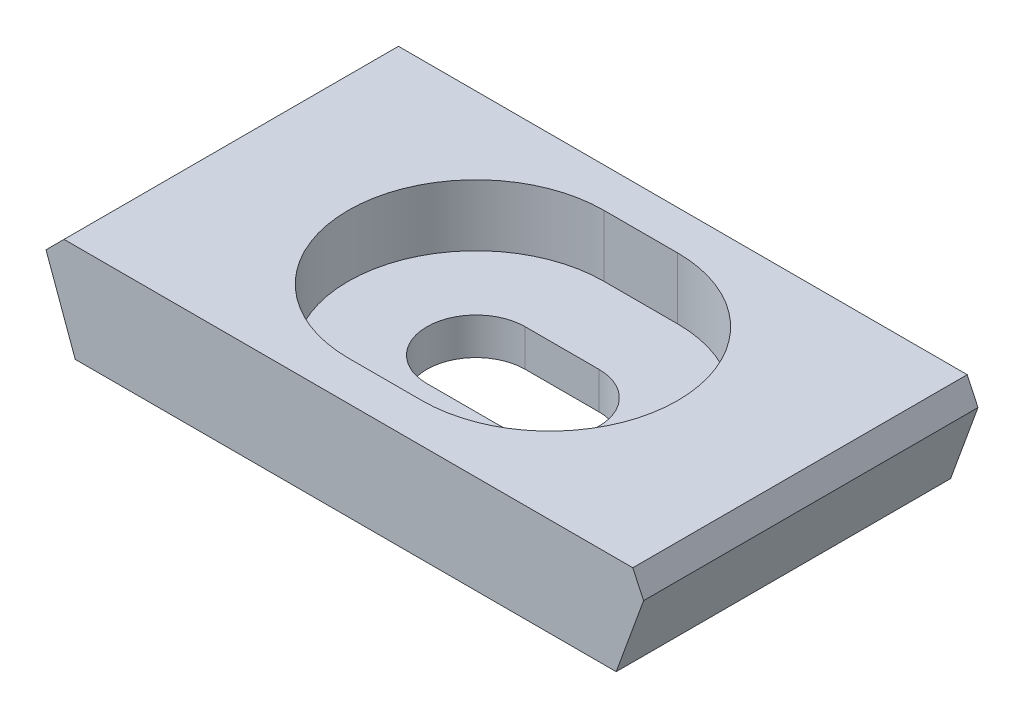
ISO-10303-21;
HEADER;
FILE_DESCRIPTION(('STEP AP214'),'2;1');
FILE_NAME('part.step','',(''),(''),'','','');
FILE_SCHEMA(('AUTOMOTIVE_DESIGN { 1 0 10303 214 1 1 1 1 }'));
ENDSEC;
DATA;
#1=APPLICATION_CONTEXT('core data for automotive mechanical design processes');
#2=APPLICATION_PROTOCOL_DEFINITION('international standard','automotive_design',2000,#1);
#3=PRODUCT_CONTEXT('',#1,'mechanical');
#4=PRODUCT('Part','Part','',(#3));
#5=PRODUCT_RELATED_PRODUCT_CATEGORY('part','',(#4));
#6=PRODUCT_DEFINITION_FORMATION('','',#4);
#7=PRODUCT_DEFINITION_CONTEXT('part definition',#1,'design');
#8=PRODUCT_DEFINITION('design','',#6,#7);
#9=PRODUCT_DEFINITION_SHAPE('','',#8);
#10=(LENGTH_UNIT() NAMED_UNIT(*) SI_UNIT(.MILLI.,.METRE.));
#11=(NAMED_UNIT(*) PLANE_ANGLE_UNIT() SI_UNIT($,.RADIAN.));
#12=(NAMED_UNIT(*) SI_UNIT($,.STERADIAN.) SOLID_ANGLE_UNIT());
#13=UNCERTAINTY_MEASURE_WITH_UNIT(LENGTH_MEASURE(1.E-05),#10,'distance_accuracy_value','');
#14=(GEOMETRIC_REPRESENTATION_CONTEXT(3) GLOBAL_UNCERTAINTY_ASSIGNED_CONTEXT((#13)) GLOBAL_UNIT_ASSIGNED_CONTEXT((#10,
#11,#12)) REPRESENTATION_CONTEXT('',''));
#15=CARTESIAN_POINT('',(0.,0.,0.));
#16=DIRECTION('',(0.,0.,1.));
#17=DIRECTION('',(1.,0.,0.));
#18=AXIS2_PLACEMENT_3D('',#15,#16,#17);
#19=CARTESIAN_POINT('',(-15.8189687900723,5.08,17.272));
#20=DIRECTION('',(0.939692620785909,0.342020143325666,0.));
#21=DIRECTION('',(-0.342020143325666,0.93969262078591,0.));
#22=AXIS2_PLACEMENT_3D('',#19,#20,#21);
#23=PLANE('',#22);
#24=DIRECTION('',(0.342020143325666,-0.939692620785909,0.));
#25=VECTOR('',#24,1.);
#26=CARTESIAN_POINT('',(-15.8189687900723,5.08,17.272));
#27=LINE('',#26,#25);
#28=CARTESIAN_POINT('',(-15.4800741530007,4.14889463707157,17.272));
#29=VERTEX_POINT('',#28);
#30=CARTESIAN_POINT('',(-13.97,0.,17.272));
#31=VERTEX_POINT('',#30);
#32=EDGE_CURVE('E249',#29,#31,#27,.T.);
#33=ORIENTED_EDGE('',*,*,#32,.F.);
#34=DIRECTION('',(0.,0.,-1.));
#35=VECTOR('',#34,1.);
#36=CARTESIAN_POINT('',(-15.4800741530007,4.14889463707157,17.272));
#37=LINE('',#36,#35);
#38=CARTESIAN_POINT('',(-15.4800741530007,4.14889463707157,0.));
#39=VERTEX_POINT('',#38);
#40=EDGE_CURVE('E280',#29,#39,#37,.T.);
#41=ORIENTED_EDGE('',*,*,#40,.T.);
#42=DIRECTION('',(0.342020143325666,-0.939692620785909,0.));
#43=VECTOR('',#42,1.);
#44=CARTESIAN_POINT('',(-15.8189687900723,5.08,0.));
#45=LINE('',#44,#43);
#46=CARTESIAN_POINT('',(-13.97,0.,0.));
#47=VERTEX_POINT('',#46);
#48=EDGE_CURVE('E239',#39,#47,#45,.T.);
#49=ORIENTED_EDGE('',*,*,#48,.T.);
#50=DIRECTION('',(0.,0.,-1.));
#51=VECTOR('',#50,1.);
#52=CARTESIAN_POINT('',(-13.97,0.,17.272));
#53=LINE('',#52,#51);
#54=EDGE_CURVE('E276',#31,#47,#53,.T.);
#55=ORIENTED_EDGE('',*,*,#54,.F.);
#56=EDGE_LOOP('',(#33,#41,#49,#55));
#57=FACE_BOUND('',#56,.T.);
#58=ADVANCED_FACE('F44',(#57),#23,.F.);
#59=CARTESIAN_POINT('',(-13.97,0.,17.272));
#60=DIRECTION('',(0.,1.,0.));
#61=DIRECTION('',(0.,0.,1.));
#62=AXIS2_PLACEMENT_3D('',#59,#60,#61);
#63=PLANE('',#62);
#64=DIRECTION('',(1.,0.,0.));
#65=VECTOR('',#64,1.);
#66=CARTESIAN_POINT('',(1.905,0.,11.176));
#67=LINE('',#66,#65);
#68=CARTESIAN_POINT('',(-1.90500000000001,0.,11.176));
#69=VERTEX_POINT('',#68);
#70=CARTESIAN_POINT('',(1.905,0.,11.176));
#71=VERTEX_POINT('',#70);
#72=EDGE_CURVE('E162',#69,#71,#67,.T.);
#73=ORIENTED_EDGE('',*,*,#72,.T.);
#74=CARTESIAN_POINT('',(1.905,0.,8.636));
#75=DIRECTION('',(0.,1.,0.));
#76=DIRECTION('',(-1.,0.,0.));
#77=AXIS2_PLACEMENT_3D('',#74,#75,#76);
#78=CIRCLE('',#77,2.54);
#79=CARTESIAN_POINT('',(1.905,0.,6.096));
#80=VERTEX_POINT('',#79);
#81=EDGE_CURVE('E153',#71,#80,#78,.T.);
#82=ORIENTED_EDGE('',*,*,#81,.T.);
#83=DIRECTION('',(-1.,0.,0.));
#84=VECTOR('',#83,1.);
#85=CARTESIAN_POINT('',(1.905,0.,6.096));
#86=LINE('',#85,#84);
#87=CARTESIAN_POINT('',(-1.90500000000001,0.,6.096));
#88=VERTEX_POINT('',#87);
#89=EDGE_CURVE('E166',#80,#88,#86,.T.);
#90=ORIENTED_EDGE('',*,*,#89,.T.);
#91=CARTESIAN_POINT('',(-1.90500000000001,0.,8.636));
#92=DIRECTION('',(0.,1.,0.));
#93=DIRECTION('',(-1.,0.,0.));
#94=AXIS2_PLACEMENT_3D('',#91,#92,#93);
#95=CIRCLE('',#94,2.54);
#96=EDGE_CURVE('E171',#88,#69,#95,.T.);
#97=ORIENTED_EDGE('',*,*,#96,.T.);
#98=EDGE_LOOP('',(#73,#82,#90,#97));
#99=FACE_BOUND('',#98,.T.);
#100=DIRECTION('',(1.,0.,0.));
#101=VECTOR('',#100,1.);
#102=CARTESIAN_POINT('',(-13.97,0.,0.));
#103=LINE('',#102,#101);
#104=CARTESIAN_POINT('',(13.97,0.,0.));
#105=VERTEX_POINT('',#104);
#106=EDGE_CURVE('E265',#47,#105,#103,.T.);
#107=ORIENTED_EDGE('',*,*,#106,.T.);
#108=DIRECTION('',(0.,0.,-1.));
#109=VECTOR('',#108,1.);
#110=CARTESIAN_POINT('',(13.97,0.,17.272));
#111=LINE('',#110,#109);
#112=CARTESIAN_POINT('',(13.97,0.,17.272));
#113=VERTEX_POINT('',#112);
#114=EDGE_CURVE('E262',#113,#105,#111,.T.);
#115=ORIENTED_EDGE('',*,*,#114,.F.);
#116=DIRECTION('',(1.,0.,0.));
#117=VECTOR('',#116,1.);
#118=CARTESIAN_POINT('',(-13.97,0.,17.272));
#119=LINE('',#118,#117);
#120=EDGE_CURVE('E252',#31,#113,#119,.T.);
#121=ORIENTED_EDGE('',*,*,#120,.F.);
#122=ORIENTED_EDGE('',*,*,#54,.T.);
#123=EDGE_LOOP('',(#107,#115,#121,#122));
#124=FACE_BOUND('',#123,.T.);
#125=ADVANCED_FACE('F173',(#99,#124),#63,.F.);
#126=CARTESIAN_POINT('',(13.97,0.,17.272));
#127=DIRECTION('',(-0.93969262078591,0.342020143325666,0.));
#128=DIRECTION('',(-0.342020143325666,-0.93969262078591,0.));
#129=AXIS2_PLACEMENT_3D('',#126,#127,#128);
#130=PLANE('',#129);
#131=DIRECTION('',(0.342020143325666,0.93969262078591,0.));
#132=VECTOR('',#131,1.);
#133=CARTESIAN_POINT('',(13.97,0.,0.));
#134=LINE('',#133,#132);
#135=CARTESIAN_POINT('',(15.3846032080487,3.88659037160189,0.));
#136=VERTEX_POINT('',#135);
#137=EDGE_CURVE('E268',#105,#136,#134,.T.);
#138=ORIENTED_EDGE('',*,*,#137,.T.);
#139=DIRECTION('',(0.,0.,1.));
#140=VECTOR('',#139,1.);
#141=CARTESIAN_POINT('',(15.3846032080487,3.88659037160189,17.272));
#142=LINE('',#141,#140);
#143=CARTESIAN_POINT('',(15.3846032080487,3.88659037160189,17.272));
#144=VERTEX_POINT('',#143);
#145=EDGE_CURVE('E12',#136,#144,#142,.T.);
#146=ORIENTED_EDGE('',*,*,#145,.T.);
#147=DIRECTION('',(0.342020143325666,0.93969262078591,0.));
#148=VECTOR('',#147,1.);
#149=CARTESIAN_POINT('',(13.97,0.,17.272));
#150=LINE('',#149,#148);
#151=EDGE_CURVE('E256',#113,#144,#150,.T.);
#152=ORIENTED_EDGE('',*,*,#151,.F.);
#153=ORIENTED_EDGE('',*,*,#114,.T.);
#154=EDGE_LOOP('',(#138,#146,#152,#153));
#155=FACE_BOUND('',#154,.T.);
#156=ADVANCED_FACE('F319',(#155),#130,.F.);
#157=CARTESIAN_POINT('',(15.8189687900723,5.08,17.272));
#158=DIRECTION('',(0.,-1.,0.));
#159=DIRECTION('',(1.,0.,0.));
#160=AXIS2_PLACEMENT_3D('',#157,#158,#159);
#161=PLANE('',#160);
#162=DIRECTION('',(-1.,0.,0.));
#163=VECTOR('',#162,1.);
#164=CARTESIAN_POINT('',(1.90499999999999,5.08,2.032));
#165=LINE('',#164,#163);
#166=CARTESIAN_POINT('',(1.90499999999999,5.08,2.032));
#167=VERTEX_POINT('',#166);
#168=CARTESIAN_POINT('',(-1.90500000000001,5.08,2.032));
#169=VERTEX_POINT('',#168);
#170=EDGE_CURVE('E225',#167,#169,#165,.T.);
#171=ORIENTED_EDGE('',*,*,#170,.F.);
#172=CARTESIAN_POINT('',(1.905,5.08,8.636));
#173=DIRECTION('',(0.,1.,0.));
#174=DIRECTION('',(-1.,0.,0.));
#175=AXIS2_PLACEMENT_3D('',#172,#173,#174);
#176=CIRCLE('',#175,6.604);
#177=CARTESIAN_POINT('',(1.905,5.08,15.24));
#178=VERTEX_POINT('',#177);
#179=EDGE_CURVE('E198',#178,#167,#176,.T.);
#180=ORIENTED_EDGE('',*,*,#179,.F.);
#181=DIRECTION('',(1.,0.,0.));
#182=VECTOR('',#181,1.);
#183=CARTESIAN_POINT('',(1.905,5.08,15.24));
#184=LINE('',#183,#182);
#185=CARTESIAN_POINT('',(-1.90500000000001,5.08,15.24));
#186=VERTEX_POINT('',#185);
#187=EDGE_CURVE('E210',#186,#178,#184,.T.);
#188=ORIENTED_EDGE('',*,*,#187,.F.);
#189=CARTESIAN_POINT('',(-1.90500000000001,5.08,8.636));
#190=DIRECTION('',(0.,1.,0.));
#191=DIRECTION('',(-1.,0.,0.));
#192=AXIS2_PLACEMENT_3D('',#189,#190,#191);
#193=CIRCLE('',#192,6.604);
#194=EDGE_CURVE('E229',#169,#186,#193,.T.);
#195=ORIENTED_EDGE('',*,*,#194,.F.);
#196=EDGE_LOOP('',(#171,#180,#188,#195));
#197=FACE_BOUND('',#196,.T.);
#198=DIRECTION('',(-1.,0.,0.));
#199=VECTOR('',#198,1.);
#200=CARTESIAN_POINT('',(15.8189687900723,5.08,0.));
#201=LINE('',#200,#199);
#202=CARTESIAN_POINT('',(14.8281071590107,5.08,0.));
#203=VERTEX_POINT('',#202);
#204=CARTESIAN_POINT('',(-14.5489687900723,5.08,0.));
#205=VERTEX_POINT('',#204);
#206=EDGE_CURVE('E253',#203,#205,#201,.T.);
#207=ORIENTED_EDGE('',*,*,#206,.T.);
#208=DIRECTION('',(0.,0.,1.));
#209=VECTOR('',#208,1.);
#210=CARTESIAN_POINT('',(-14.5489687900723,5.08,17.272));
#211=LINE('',#210,#209);
#212=CARTESIAN_POINT('',(-14.5489687900723,5.08,17.272));
#213=VERTEX_POINT('',#212);
#214=EDGE_CURVE('E67',#205,#213,#211,.T.);
#215=ORIENTED_EDGE('',*,*,#214,.T.);
#216=DIRECTION('',(-1.,0.,0.));
#217=VECTOR('',#216,1.);
#218=CARTESIAN_POINT('',(15.8189687900723,5.08,17.272));
#219=LINE('',#218,#217);
#220=CARTESIAN_POINT('',(14.8281071590107,5.08,17.272));
#221=VERTEX_POINT('',#220);
#222=EDGE_CURVE('E259',#221,#213,#219,.T.);
#223=ORIENTED_EDGE('',*,*,#222,.F.);
#224=DIRECTION('',(0.,0.,-1.));
#225=VECTOR('',#224,1.);
#226=CARTESIAN_POINT('',(14.8281071590107,5.08,17.272));
#227=LINE('',#226,#225);
#228=EDGE_CURVE('E290',#221,#203,#227,.T.);
#229=ORIENTED_EDGE('',*,*,#228,.T.);
#230=EDGE_LOOP('',(#207,#215,#223,#229));
#231=FACE_BOUND('',#230,.T.);
#232=ADVANCED_FACE('F314',(#197,#231),#161,.F.);
#233=CARTESIAN_POINT('',(0.,0.,17.272));
#234=DIRECTION('',(0.,0.,1.));
#235=DIRECTION('',(1.,0.,0.));
#236=AXIS2_PLACEMENT_3D('',#233,#234,#235);
#237=PLANE('',#236);
#238=ORIENTED_EDGE('',*,*,#222,.T.);
#239=DIRECTION('',(0.70710678118655,0.707106781186545,0.));
#240=VECTOR('',#239,1.);
#241=CARTESIAN_POINT('',(-9.8144843950361,9.81448439503616,17.272));
#242=LINE('',#241,#240);
#243=EDGE_CURVE('E54',#213,#29,#242,.F.);
#244=ORIENTED_EDGE('',*,*,#243,.T.);
#245=ORIENTED_EDGE('',*,*,#32,.T.);
#246=ORIENTED_EDGE('',*,*,#120,.T.);
#247=ORIENTED_EDGE('',*,*,#151,.T.);
#248=DIRECTION('',(0.422618261740702,-0.906307787036649,0.));
#249=VECTOR('',#248,1.);
#250=CARTESIAN_POINT('',(14.1254682434857,6.58681401696268,17.272));
#251=LINE('',#250,#249);
#252=EDGE_CURVE('E296',#144,#221,#251,.F.);
#253=ORIENTED_EDGE('',*,*,#252,.T.);
#254=EDGE_LOOP('',(#238,#244,#245,#246,#247,#253));
#255=FACE_BOUND('',#254,.T.);
#256=ADVANCED_FACE('F302',(#255),#237,.T.);
#257=CARTESIAN_POINT('',(0.,0.,0.));
#258=DIRECTION('',(0.,0.,1.));
#259=DIRECTION('',(1.,0.,0.));
#260=AXIS2_PLACEMENT_3D('',#257,#258,#259);
#261=PLANE('',#260);
#262=ORIENTED_EDGE('',*,*,#48,.F.);
#263=DIRECTION('',(-0.70710678118655,-0.707106781186545,0.));
#264=VECTOR('',#263,1.);
#265=CARTESIAN_POINT('',(-15.4800741530007,4.14889463707157,0.));
#266=LINE('',#265,#264);
#267=EDGE_CURVE('E287',#39,#205,#266,.F.);
#268=ORIENTED_EDGE('',*,*,#267,.T.);
#269=ORIENTED_EDGE('',*,*,#206,.F.);
#270=DIRECTION('',(-0.422618261740702,0.906307787036649,0.));
#271=VECTOR('',#270,1.);
#272=CARTESIAN_POINT('',(14.8281071590107,5.08,0.));
#273=LINE('',#272,#271);
#274=EDGE_CURVE('E284',#203,#136,#273,.F.);
#275=ORIENTED_EDGE('',*,*,#274,.T.);
#276=ORIENTED_EDGE('',*,*,#137,.F.);
#277=ORIENTED_EDGE('',*,*,#106,.F.);
#278=EDGE_LOOP('',(#262,#268,#269,#275,#276,#277));
#279=FACE_BOUND('',#278,.T.);
#280=ADVANCED_FACE('F312',(#279),#261,.F.);
#281=CARTESIAN_POINT('',(1.905,1.905,8.636));
#282=DIRECTION('',(0.,1.,0.));
#283=DIRECTION('',(-1.,0.,0.));
#284=AXIS2_PLACEMENT_3D('',#281,#282,#283);
#285=CYLINDRICAL_SURFACE('',#284,6.604);
#286=ORIENTED_EDGE('',*,*,#179,.T.);
#287=DIRECTION('',(0.,1.,0.));
#288=VECTOR('',#287,1.);
#289=CARTESIAN_POINT('',(1.90499999999999,1.905,2.032));
#290=LINE('',#289,#288);
#291=CARTESIAN_POINT('',(1.90499999999999,1.905,2.032));
#292=VERTEX_POINT('',#291);
#293=EDGE_CURVE('E222',#292,#167,#290,.T.);
#294=ORIENTED_EDGE('',*,*,#293,.F.);
#295=CARTESIAN_POINT('',(1.905,1.905,8.636));
#296=DIRECTION('',(0.,1.,0.));
#297=DIRECTION('',(-1.,0.,0.));
#298=AXIS2_PLACEMENT_3D('',#295,#296,#297);
#299=CIRCLE('',#298,6.604);
#300=CARTESIAN_POINT('',(1.905,1.905,15.24));
#301=VERTEX_POINT('',#300);
#302=EDGE_CURVE('E205',#301,#292,#299,.T.);
#303=ORIENTED_EDGE('',*,*,#302,.F.);
#304=DIRECTION('',(0.,1.,0.));
#305=VECTOR('',#304,1.);
#306=CARTESIAN_POINT('',(1.905,1.905,15.24));
#307=LINE('',#306,#305);
#308=EDGE_CURVE('E236',#301,#178,#307,.T.);
#309=ORIENTED_EDGE('',*,*,#308,.T.);
#310=EDGE_LOOP('',(#286,#294,#303,#309));
#311=FACE_BOUND('',#310,.T.);
#312=ADVANCED_FACE('F359',(#311),#285,.F.);
#313=CARTESIAN_POINT('',(1.905,1.905,15.24));
#314=DIRECTION('',(0.,0.,1.));
#315=DIRECTION('',(1.,0.,0.));
#316=AXIS2_PLACEMENT_3D('',#313,#314,#315);
#317=PLANE('',#316);
#318=ORIENTED_EDGE('',*,*,#187,.T.);
#319=ORIENTED_EDGE('',*,*,#308,.F.);
#320=DIRECTION('',(1.,0.,0.));
#321=VECTOR('',#320,1.);
#322=CARTESIAN_POINT('',(1.905,1.905,15.24));
#323=LINE('',#322,#321);
#324=CARTESIAN_POINT('',(-1.90500000000001,1.905,15.24));
#325=VERTEX_POINT('',#324);
#326=EDGE_CURVE('E218',#325,#301,#323,.T.);
#327=ORIENTED_EDGE('',*,*,#326,.F.);
#328=DIRECTION('',(0.,1.,0.));
#329=VECTOR('',#328,1.);
#330=CARTESIAN_POINT('',(-1.90500000000001,1.905,15.24));
#331=LINE('',#330,#329);
#332=EDGE_CURVE('E240',#325,#186,#331,.T.);
#333=ORIENTED_EDGE('',*,*,#332,.T.);
#334=EDGE_LOOP('',(#318,#319,#327,#333));
#335=FACE_BOUND('',#334,.T.);
#336=ADVANCED_FACE('F355',(#335),#317,.F.);
#337=CARTESIAN_POINT('',(-1.90500000000001,1.905,8.636));
#338=DIRECTION('',(0.,1.,0.));
#339=DIRECTION('',(-1.,0.,0.));
#340=AXIS2_PLACEMENT_3D('',#337,#338,#339);
#341=CYLINDRICAL_SURFACE('',#340,6.604);
#342=ORIENTED_EDGE('',*,*,#194,.T.);
#343=ORIENTED_EDGE('',*,*,#332,.F.);
#344=CARTESIAN_POINT('',(-1.90500000000001,1.905,8.636));
#345=DIRECTION('',(0.,1.,0.));
#346=DIRECTION('',(-1.,0.,0.));
#347=AXIS2_PLACEMENT_3D('',#344,#345,#346);
#348=CIRCLE('',#347,6.604);
#349=CARTESIAN_POINT('',(-1.90500000000001,1.905,2.032));
#350=VERTEX_POINT('',#349);
#351=EDGE_CURVE('E214',#350,#325,#348,.T.);
#352=ORIENTED_EDGE('',*,*,#351,.F.);
#353=DIRECTION('',(0.,1.,0.));
#354=VECTOR('',#353,1.);
#355=CARTESIAN_POINT('',(-1.90500000000001,1.905,2.032));
#356=LINE('',#355,#354);
#357=EDGE_CURVE('E243',#350,#169,#356,.T.);
#358=ORIENTED_EDGE('',*,*,#357,.T.);
#359=EDGE_LOOP('',(#342,#343,#352,#358));
#360=FACE_BOUND('',#359,.T.);
#361=ADVANCED_FACE('F358',(#360),#341,.F.);
#362=CARTESIAN_POINT('',(1.90499999999999,1.905,2.032));
#363=DIRECTION('',(0.,0.,-1.));
#364=DIRECTION('',(-1.,0.,0.));
#365=AXIS2_PLACEMENT_3D('',#362,#363,#364);
#366=PLANE('',#365);
#367=ORIENTED_EDGE('',*,*,#170,.T.);
#368=ORIENTED_EDGE('',*,*,#357,.F.);
#369=DIRECTION('',(-1.,0.,0.));
#370=VECTOR('',#369,1.);
#371=CARTESIAN_POINT('',(1.90499999999999,1.905,2.032));
#372=LINE('',#371,#370);
#373=EDGE_CURVE('E209',#292,#350,#372,.T.);
#374=ORIENTED_EDGE('',*,*,#373,.F.);
#375=ORIENTED_EDGE('',*,*,#293,.T.);
#376=EDGE_LOOP('',(#367,#368,#374,#375));
#377=FACE_BOUND('',#376,.T.);
#378=ADVANCED_FACE('F353',(#377),#366,.F.);
#379=CARTESIAN_POINT('',(1.905,1.905,8.636));
#380=DIRECTION('',(0.,1.,0.));
#381=DIRECTION('',(-1.,0.,0.));
#382=AXIS2_PLACEMENT_3D('',#379,#380,#381);
#383=PLANE('',#382);
#384=CARTESIAN_POINT('',(1.905,1.905,8.636));
#385=DIRECTION('',(0.,1.,0.));
#386=DIRECTION('',(-1.,0.,0.));
#387=AXIS2_PLACEMENT_3D('',#384,#385,#386);
#388=CIRCLE('',#387,2.54);
#389=CARTESIAN_POINT('',(1.905,1.905,11.176));
#390=VERTEX_POINT('',#389);
#391=CARTESIAN_POINT('',(1.905,1.905,6.096));
#392=VERTEX_POINT('',#391);
#393=EDGE_CURVE('E156',#390,#392,#388,.T.);
#394=ORIENTED_EDGE('',*,*,#393,.F.);
#395=DIRECTION('',(1.,0.,0.));
#396=VECTOR('',#395,1.);
#397=CARTESIAN_POINT('',(1.905,1.905,11.176));
#398=LINE('',#397,#396);
#399=CARTESIAN_POINT('',(-1.90500000000001,1.905,11.176));
#400=VERTEX_POINT('',#399);
#401=EDGE_CURVE('E177',#400,#390,#398,.T.);
#402=ORIENTED_EDGE('',*,*,#401,.F.);
#403=CARTESIAN_POINT('',(-1.90500000000001,1.905,8.636));
#404=DIRECTION('',(0.,1.,0.));
#405=DIRECTION('',(-1.,0.,0.));
#406=AXIS2_PLACEMENT_3D('',#403,#404,#405);
#407=CIRCLE('',#406,2.54);
#408=CARTESIAN_POINT('',(-1.90500000000001,1.905,6.096));
#409=VERTEX_POINT('',#408);
#410=EDGE_CURVE('E181',#409,#400,#407,.T.);
#411=ORIENTED_EDGE('',*,*,#410,.F.);
#412=DIRECTION('',(-1.,0.,0.));
#413=VECTOR('',#412,1.);
#414=CARTESIAN_POINT('',(1.905,1.905,6.096));
#415=LINE('',#414,#413);
#416=EDGE_CURVE('E190',#392,#409,#415,.T.);
#417=ORIENTED_EDGE('',*,*,#416,.F.);
#418=EDGE_LOOP('',(#394,#402,#411,#417));
#419=FACE_BOUND('',#418,.T.);
#420=ORIENTED_EDGE('',*,*,#302,.T.);
#421=ORIENTED_EDGE('',*,*,#373,.T.);
#422=ORIENTED_EDGE('',*,*,#351,.T.);
#423=ORIENTED_EDGE('',*,*,#326,.T.);
#424=EDGE_LOOP('',(#420,#421,#422,#423));
#425=FACE_BOUND('',#424,.T.);
#426=ADVANCED_FACE('F350',(#419,#425),#383,.T.);
#427=CARTESIAN_POINT('',(1.905,0.,8.636));
#428=DIRECTION('',(0.,1.,0.));
#429=DIRECTION('',(-1.,0.,0.));
#430=AXIS2_PLACEMENT_3D('',#427,#428,#429);
#431=CYLINDRICAL_SURFACE('',#430,2.54);
#432=ORIENTED_EDGE('',*,*,#393,.T.);
#433=DIRECTION('',(0.,1.,0.));
#434=VECTOR('',#433,1.);
#435=CARTESIAN_POINT('',(1.905,0.,6.096));
#436=LINE('',#435,#434);
#437=EDGE_CURVE('E149',#80,#392,#436,.T.);
#438=ORIENTED_EDGE('',*,*,#437,.F.);
#439=ORIENTED_EDGE('',*,*,#81,.F.);
#440=DIRECTION('',(0.,1.,0.));
#441=VECTOR('',#440,1.);
#442=CARTESIAN_POINT('',(1.905,0.,11.176));
#443=LINE('',#442,#441);
#444=EDGE_CURVE('E195',#71,#390,#443,.T.);
#445=ORIENTED_EDGE('',*,*,#444,.T.);
#446=EDGE_LOOP('',(#432,#438,#439,#445));
#447=FACE_BOUND('',#446,.T.);
#448=ADVANCED_FACE('F151',(#447),#431,.F.);
#449=CARTESIAN_POINT('',(1.905,0.,11.176));
#450=DIRECTION('',(0.,0.,1.));
#451=DIRECTION('',(1.,0.,0.));
#452=AXIS2_PLACEMENT_3D('',#449,#450,#451);
#453=PLANE('',#452);
#454=ORIENTED_EDGE('',*,*,#401,.T.);
#455=ORIENTED_EDGE('',*,*,#444,.F.);
#456=ORIENTED_EDGE('',*,*,#72,.F.);
#457=DIRECTION('',(0.,1.,0.));
#458=VECTOR('',#457,1.);
#459=CARTESIAN_POINT('',(-1.90500000000001,0.,11.176));
#460=LINE('',#459,#458);
#461=EDGE_CURVE('E199',#69,#400,#460,.T.);
#462=ORIENTED_EDGE('',*,*,#461,.T.);
#463=EDGE_LOOP('',(#454,#455,#456,#462));
#464=FACE_BOUND('',#463,.T.);
#465=ADVANCED_FACE('F343',(#464),#453,.F.);
#466=CARTESIAN_POINT('',(-1.90500000000001,0.,8.636));
#467=DIRECTION('',(0.,1.,0.));
#468=DIRECTION('',(-1.,0.,0.));
#469=AXIS2_PLACEMENT_3D('',#466,#467,#468);
#470=CYLINDRICAL_SURFACE('',#469,2.54);
#471=ORIENTED_EDGE('',*,*,#410,.T.);
#472=ORIENTED_EDGE('',*,*,#461,.F.);
#473=ORIENTED_EDGE('',*,*,#96,.F.);
#474=DIRECTION('',(0.,1.,0.));
#475=VECTOR('',#474,1.);
#476=CARTESIAN_POINT('',(-1.90500000000001,0.,6.096));
#477=LINE('',#476,#475);
#478=EDGE_CURVE('E161',#88,#409,#477,.T.);
#479=ORIENTED_EDGE('',*,*,#478,.T.);
#480=EDGE_LOOP('',(#471,#472,#473,#479));
#481=FACE_BOUND('',#480,.T.);
#482=ADVANCED_FACE('F338',(#481),#470,.F.);
#483=CARTESIAN_POINT('',(1.905,0.,6.096));
#484=DIRECTION('',(0.,0.,-1.));
#485=DIRECTION('',(-1.,0.,0.));
#486=AXIS2_PLACEMENT_3D('',#483,#484,#485);
#487=PLANE('',#486);
#488=ORIENTED_EDGE('',*,*,#416,.T.);
#489=ORIENTED_EDGE('',*,*,#478,.F.);
#490=ORIENTED_EDGE('',*,*,#89,.F.);
#491=ORIENTED_EDGE('',*,*,#437,.T.);
#492=EDGE_LOOP('',(#488,#489,#490,#491));
#493=FACE_BOUND('',#492,.T.);
#494=ADVANCED_FACE('F167',(#493),#487,.F.);
#495=CARTESIAN_POINT('',(-15.4800741530007,4.14889463707157,17.272));
#496=DIRECTION('',(0.707106781186545,-0.70710678118655,0.));
#497=DIRECTION('',(0.,0.,-1.));
#498=AXIS2_PLACEMENT_3D('',#495,#496,#497);
#499=PLANE('',#498);
#500=ORIENTED_EDGE('',*,*,#243,.F.);
#501=ORIENTED_EDGE('',*,*,#214,.F.);
#502=ORIENTED_EDGE('',*,*,#267,.F.);
#503=ORIENTED_EDGE('',*,*,#40,.F.);
#504=EDGE_LOOP('',(#500,#501,#502,#503));
#505=FACE_BOUND('',#504,.T.);
#506=ADVANCED_FACE('F309',(#505),#499,.F.);
#507=CARTESIAN_POINT('',(14.8281071590107,5.08,17.272));
#508=DIRECTION('',(-0.906307787036649,-0.422618261740702,0.));
#509=DIRECTION('',(0.,0.,-1.));
#510=AXIS2_PLACEMENT_3D('',#507,#508,#509);
#511=PLANE('',#510);
#512=ORIENTED_EDGE('',*,*,#252,.F.);
#513=ORIENTED_EDGE('',*,*,#145,.F.);
#514=ORIENTED_EDGE('',*,*,#274,.F.);
#515=ORIENTED_EDGE('',*,*,#228,.F.);
#516=EDGE_LOOP('',(#512,#513,#514,#515));
#517=FACE_BOUND('',#516,.T.);
#518=ADVANCED_FACE('F47',(#517),#511,.F.);
#519=CLOSED_SHELL('',(#58,#125,#156,#232,#256,#280,#312,#336,#361,#378,#426,#448,#465,#482,#494,
#506,#518));
#520=MANIFOLD_SOLID_BREP('B2',#519);
#521=ADVANCED_BREP_SHAPE_REPRESENTATION('',(#18,#520),#14);
#522=SHAPE_DEFINITION_REPRESENTATION(#9,#521);
ENDSEC;
END-ISO-10303-21;
